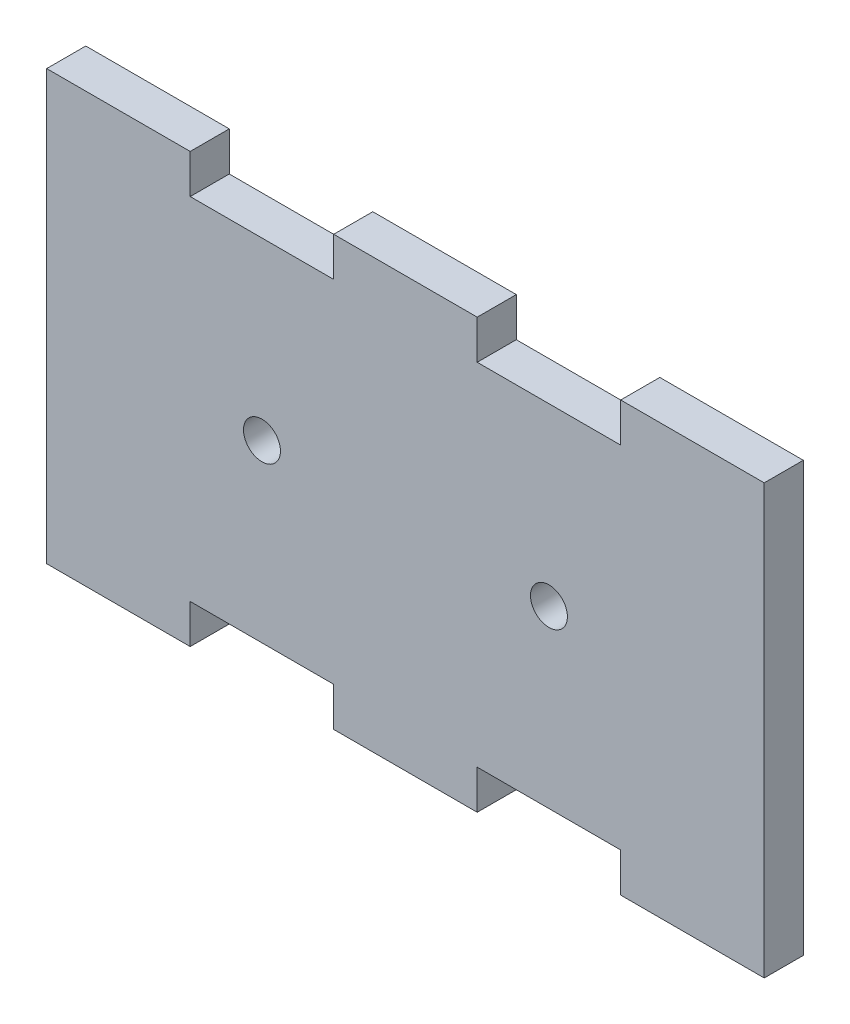
ISO-10303-21;
HEADER;
FILE_DESCRIPTION(('STEP AP214'),'2;1');
FILE_NAME('part.step','',(''),(''),'','','');
FILE_SCHEMA(('AUTOMOTIVE_DESIGN { 1 0 10303 214 1 1 1 1 }'));
ENDSEC;
DATA;
#1=APPLICATION_CONTEXT('core data for automotive mechanical design processes');
#2=APPLICATION_PROTOCOL_DEFINITION('international standard','automotive_design',2000,#1);
#3=PRODUCT_CONTEXT('',#1,'mechanical');
#4=PRODUCT('Part','Part','',(#3));
#5=PRODUCT_RELATED_PRODUCT_CATEGORY('part','',(#4));
#6=PRODUCT_DEFINITION_FORMATION('','',#4);
#7=PRODUCT_DEFINITION_CONTEXT('part definition',#1,'design');
#8=PRODUCT_DEFINITION('design','',#6,#7);
#9=PRODUCT_DEFINITION_SHAPE('','',#8);
#10=(LENGTH_UNIT() NAMED_UNIT(*) SI_UNIT(.MILLI.,.METRE.));
#11=(NAMED_UNIT(*) PLANE_ANGLE_UNIT() SI_UNIT($,.RADIAN.));
#12=(NAMED_UNIT(*) SI_UNIT($,.STERADIAN.) SOLID_ANGLE_UNIT());
#13=UNCERTAINTY_MEASURE_WITH_UNIT(LENGTH_MEASURE(1.E-05),#10,'distance_accuracy_value','');
#14=(GEOMETRIC_REPRESENTATION_CONTEXT(3) GLOBAL_UNCERTAINTY_ASSIGNED_CONTEXT((#13)) GLOBAL_UNIT_ASSIGNED_CONTEXT((#10,
#11,#12)) REPRESENTATION_CONTEXT('',''));
#15=CARTESIAN_POINT('',(0.,0.,0.));
#16=DIRECTION('',(0.,0.,1.));
#17=DIRECTION('',(1.,0.,0.));
#18=AXIS2_PLACEMENT_3D('',#15,#16,#17);
#19=CARTESIAN_POINT('',(17.485,0.,3.175));
#20=DIRECTION('',(0.,0.,-1.));
#21=DIRECTION('',(-1.,0.,0.));
#22=AXIS2_PLACEMENT_3D('',#19,#20,#21);
#23=CYLINDRICAL_SURFACE('',#22,1.5);
#24=CARTESIAN_POINT('',(17.485,0.,0.));
#25=DIRECTION('',(0.,0.,-1.));
#26=DIRECTION('',(1.,0.,0.));
#27=AXIS2_PLACEMENT_3D('',#24,#25,#26);
#28=CIRCLE('',#27,1.5);
#29=CARTESIAN_POINT('',(18.985,0.,0.));
#30=VERTEX_POINT('',#29);
#31=EDGE_CURVE('E131',#30,#30,#28,.T.);
#32=ORIENTED_EDGE('',*,*,#31,.T.);
#33=EDGE_LOOP('',(#32));
#34=FACE_BOUND('',#33,.T.);
#35=CARTESIAN_POINT('',(17.485,0.,3.175));
#36=DIRECTION('',(0.,0.,-1.));
#37=DIRECTION('',(1.,0.,0.));
#38=AXIS2_PLACEMENT_3D('',#35,#36,#37);
#39=CIRCLE('',#38,1.5);
#40=CARTESIAN_POINT('',(18.985,0.,3.175));
#41=VERTEX_POINT('',#40);
#42=EDGE_CURVE('E203',#41,#41,#39,.T.);
#43=ORIENTED_EDGE('',*,*,#42,.F.);
#44=EDGE_LOOP('',(#43));
#45=FACE_BOUND('',#44,.T.);
#46=ADVANCED_FACE('F39',(#34,#45),#23,.F.);
#47=CARTESIAN_POINT('',(29.14,17.415,3.175));
#48=DIRECTION('',(0.,-1.,0.));
#49=DIRECTION('',(0.,0.,-1.));
#50=AXIS2_PLACEMENT_3D('',#47,#48,#49);
#51=PLANE('',#50);
#52=DIRECTION('',(-1.,0.,0.));
#53=VECTOR('',#52,1.);
#54=CARTESIAN_POINT('',(29.14,17.415,0.));
#55=LINE('',#54,#53);
#56=CARTESIAN_POINT('',(34.968,17.415,0.));
#57=VERTEX_POINT('',#56);
#58=CARTESIAN_POINT('',(23.312,17.415,0.));
#59=VERTEX_POINT('',#58);
#60=EDGE_CURVE('E135',#57,#59,#55,.T.);
#61=ORIENTED_EDGE('',*,*,#60,.T.);
#62=DIRECTION('',(0.,0.,-1.));
#63=VECTOR('',#62,1.);
#64=CARTESIAN_POINT('',(23.312,17.415,3.175));
#65=LINE('',#64,#63);
#66=CARTESIAN_POINT('',(23.312,17.415,3.175));
#67=VERTEX_POINT('',#66);
#68=EDGE_CURVE('E11',#67,#59,#65,.T.);
#69=ORIENTED_EDGE('',*,*,#68,.F.);
#70=DIRECTION('',(-1.,0.,0.));
#71=VECTOR('',#70,1.);
#72=CARTESIAN_POINT('',(29.14,17.415,3.175));
#73=LINE('',#72,#71);
#74=CARTESIAN_POINT('',(34.968,17.415,3.175));
#75=VERTEX_POINT('',#74);
#76=EDGE_CURVE('E93',#75,#67,#73,.T.);
#77=ORIENTED_EDGE('',*,*,#76,.F.);
#78=DIRECTION('',(0.,0.,-1.));
#79=VECTOR('',#78,1.);
#80=CARTESIAN_POINT('',(34.968,17.415,3.175));
#81=LINE('',#80,#79);
#82=EDGE_CURVE('E250',#75,#57,#81,.T.);
#83=ORIENTED_EDGE('',*,*,#82,.T.);
#84=EDGE_LOOP('',(#61,#69,#77,#83));
#85=FACE_BOUND('',#84,.T.);
#86=ADVANCED_FACE('F213',(#85),#51,.F.);
#87=CARTESIAN_POINT('',(23.312,14.24,3.175));
#88=DIRECTION('',(1.,0.,0.));
#89=DIRECTION('',(0.,0.,-1.));
#90=AXIS2_PLACEMENT_3D('',#87,#88,#89);
#91=PLANE('',#90);
#92=DIRECTION('',(0.,-1.,0.));
#93=VECTOR('',#92,1.);
#94=CARTESIAN_POINT('',(23.312,14.24,0.));
#95=LINE('',#94,#93);
#96=CARTESIAN_POINT('',(23.312,14.24,0.));
#97=VERTEX_POINT('',#96);
#98=EDGE_CURVE('E139',#59,#97,#95,.T.);
#99=ORIENTED_EDGE('',*,*,#98,.T.);
#100=DIRECTION('',(0.,0.,-1.));
#101=VECTOR('',#100,1.);
#102=CARTESIAN_POINT('',(23.312,14.24,3.175));
#103=LINE('',#102,#101);
#104=CARTESIAN_POINT('',(23.312,14.24,3.175));
#105=VERTEX_POINT('',#104);
#106=EDGE_CURVE('E48',#105,#97,#103,.T.);
#107=ORIENTED_EDGE('',*,*,#106,.F.);
#108=DIRECTION('',(0.,-1.,0.));
#109=VECTOR('',#108,1.);
#110=CARTESIAN_POINT('',(23.312,14.24,3.175));
#111=LINE('',#110,#109);
#112=EDGE_CURVE('E108',#67,#105,#111,.T.);
#113=ORIENTED_EDGE('',*,*,#112,.F.);
#114=ORIENTED_EDGE('',*,*,#68,.T.);
#115=EDGE_LOOP('',(#99,#107,#113,#114));
#116=FACE_BOUND('',#115,.T.);
#117=ADVANCED_FACE('F218',(#116),#91,.F.);
#118=CARTESIAN_POINT('',(11.656,14.24,3.175));
#119=DIRECTION('',(0.,-1.,0.));
#120=DIRECTION('',(0.,0.,-1.));
#121=AXIS2_PLACEMENT_3D('',#118,#119,#120);
#122=PLANE('',#121);
#123=DIRECTION('',(-1.,0.,0.));
#124=VECTOR('',#123,1.);
#125=CARTESIAN_POINT('',(11.656,14.24,0.));
#126=LINE('',#125,#124);
#127=CARTESIAN_POINT('',(11.656,14.24,0.));
#128=VERTEX_POINT('',#127);
#129=EDGE_CURVE('E117',#97,#128,#126,.T.);
#130=ORIENTED_EDGE('',*,*,#129,.T.);
#131=DIRECTION('',(0.,0.,-1.));
#132=VECTOR('',#131,1.);
#133=CARTESIAN_POINT('',(11.656,14.24,3.175));
#134=LINE('',#133,#132);
#135=CARTESIAN_POINT('',(11.656,14.24,3.175));
#136=VERTEX_POINT('',#135);
#137=EDGE_CURVE('E114',#136,#128,#134,.T.);
#138=ORIENTED_EDGE('',*,*,#137,.F.);
#139=DIRECTION('',(-1.,0.,0.));
#140=VECTOR('',#139,1.);
#141=CARTESIAN_POINT('',(11.656,14.24,3.175));
#142=LINE('',#141,#140);
#143=EDGE_CURVE('E101',#105,#136,#142,.T.);
#144=ORIENTED_EDGE('',*,*,#143,.F.);
#145=ORIENTED_EDGE('',*,*,#106,.T.);
#146=EDGE_LOOP('',(#130,#138,#144,#145));
#147=FACE_BOUND('',#146,.T.);
#148=ADVANCED_FACE('F115',(#147),#122,.F.);
#149=CARTESIAN_POINT('',(11.656,14.24,3.175));
#150=DIRECTION('',(-1.,0.,0.));
#151=DIRECTION('',(0.,0.,1.));
#152=AXIS2_PLACEMENT_3D('',#149,#150,#151);
#153=PLANE('',#152);
#154=DIRECTION('',(0.,1.,0.));
#155=VECTOR('',#154,1.);
#156=CARTESIAN_POINT('',(11.656,14.24,0.));
#157=LINE('',#156,#155);
#158=CARTESIAN_POINT('',(11.656,17.415,0.));
#159=VERTEX_POINT('',#158);
#160=EDGE_CURVE('E78',#128,#159,#157,.T.);
#161=ORIENTED_EDGE('',*,*,#160,.T.);
#162=DIRECTION('',(0.,0.,-1.));
#163=VECTOR('',#162,1.);
#164=CARTESIAN_POINT('',(11.656,17.415,3.175));
#165=LINE('',#164,#163);
#166=CARTESIAN_POINT('',(11.656,17.415,3.175));
#167=VERTEX_POINT('',#166);
#168=EDGE_CURVE('E119',#167,#159,#165,.T.);
#169=ORIENTED_EDGE('',*,*,#168,.F.);
#170=DIRECTION('',(0.,1.,0.));
#171=VECTOR('',#170,1.);
#172=CARTESIAN_POINT('',(11.656,14.24,3.175));
#173=LINE('',#172,#171);
#174=EDGE_CURVE('E106',#136,#167,#173,.T.);
#175=ORIENTED_EDGE('',*,*,#174,.F.);
#176=ORIENTED_EDGE('',*,*,#137,.T.);
#177=EDGE_LOOP('',(#161,#169,#175,#176));
#178=FACE_BOUND('',#177,.T.);
#179=ADVANCED_FACE('F121',(#178),#153,.F.);
#180=CARTESIAN_POINT('',(0.,17.415,3.175));
#181=DIRECTION('',(0.,-1.,0.));
#182=DIRECTION('',(0.,0.,-1.));
#183=AXIS2_PLACEMENT_3D('',#180,#181,#182);
#184=PLANE('',#183);
#185=DIRECTION('',(-1.,0.,0.));
#186=VECTOR('',#185,1.);
#187=CARTESIAN_POINT('',(0.,17.415,0.));
#188=LINE('',#187,#186);
#189=CARTESIAN_POINT('',(0.,17.415,0.));
#190=VERTEX_POINT('',#189);
#191=EDGE_CURVE('E85',#159,#190,#188,.T.);
#192=ORIENTED_EDGE('',*,*,#191,.T.);
#193=DIRECTION('',(0.,0.,-1.));
#194=VECTOR('',#193,1.);
#195=CARTESIAN_POINT('',(0.,17.415,3.175));
#196=LINE('',#195,#194);
#197=CARTESIAN_POINT('',(0.,17.415,3.175));
#198=VERTEX_POINT('',#197);
#199=EDGE_CURVE('E127',#198,#190,#196,.T.);
#200=ORIENTED_EDGE('',*,*,#199,.F.);
#201=DIRECTION('',(-1.,0.,0.));
#202=VECTOR('',#201,1.);
#203=CARTESIAN_POINT('',(0.,17.415,3.175));
#204=LINE('',#203,#202);
#205=EDGE_CURVE('E124',#167,#198,#204,.T.);
#206=ORIENTED_EDGE('',*,*,#205,.F.);
#207=ORIENTED_EDGE('',*,*,#168,.T.);
#208=EDGE_LOOP('',(#192,#200,#206,#207));
#209=FACE_BOUND('',#208,.T.);
#210=ADVANCED_FACE('F236',(#209),#184,.F.);
#211=CARTESIAN_POINT('',(0.,14.24,3.175));
#212=DIRECTION('',(1.,0.,0.));
#213=DIRECTION('',(0.,0.,-1.));
#214=AXIS2_PLACEMENT_3D('',#211,#212,#213);
#215=PLANE('',#214);
#216=DIRECTION('',(0.,-1.,0.));
#217=VECTOR('',#216,1.);
#218=CARTESIAN_POINT('',(0.,14.24,0.));
#219=LINE('',#218,#217);
#220=CARTESIAN_POINT('',(0.,-17.415,0.));
#221=VERTEX_POINT('',#220);
#222=EDGE_CURVE('E148',#190,#221,#219,.T.);
#223=ORIENTED_EDGE('',*,*,#222,.T.);
#224=DIRECTION('',(0.,0.,-1.));
#225=VECTOR('',#224,1.);
#226=CARTESIAN_POINT('',(0.,-17.415,3.175));
#227=LINE('',#226,#225);
#228=CARTESIAN_POINT('',(0.,-17.415,3.175));
#229=VERTEX_POINT('',#228);
#230=EDGE_CURVE('E169',#229,#221,#227,.T.);
#231=ORIENTED_EDGE('',*,*,#230,.F.);
#232=DIRECTION('',(0.,-1.,0.));
#233=VECTOR('',#232,1.);
#234=CARTESIAN_POINT('',(0.,0.,3.175));
#235=LINE('',#234,#233);
#236=EDGE_CURVE('E56',#198,#229,#235,.T.);
#237=ORIENTED_EDGE('',*,*,#236,.F.);
#238=ORIENTED_EDGE('',*,*,#199,.T.);
#239=EDGE_LOOP('',(#223,#231,#237,#238));
#240=FACE_BOUND('',#239,.T.);
#241=ADVANCED_FACE('F168',(#240),#215,.F.);
#242=CARTESIAN_POINT('',(17.485,0.,3.175));
#243=DIRECTION('',(0.,0.,1.));
#244=DIRECTION('',(1.,0.,0.));
#245=AXIS2_PLACEMENT_3D('',#242,#243,#244);
#246=PLANE('',#245);
#247=ORIENTED_EDGE('',*,*,#42,.T.);
#248=EDGE_LOOP('',(#247));
#249=FACE_BOUND('',#248,.T.);
#250=ORIENTED_EDGE('',*,*,#236,.T.);
#251=DIRECTION('',(-1.,0.,0.));
#252=VECTOR('',#251,1.);
#253=CARTESIAN_POINT('',(0.,-17.415,3.175));
#254=LINE('',#253,#252);
#255=CARTESIAN_POINT('',(11.656,-17.415,3.175));
#256=VERTEX_POINT('',#255);
#257=EDGE_CURVE('E178',#256,#229,#254,.T.);
#258=ORIENTED_EDGE('',*,*,#257,.F.);
#259=DIRECTION('',(0.,-1.,0.));
#260=VECTOR('',#259,1.);
#261=CARTESIAN_POINT('',(11.656,-14.24,3.175));
#262=LINE('',#261,#260);
#263=CARTESIAN_POINT('',(11.656,-14.24,3.175));
#264=VERTEX_POINT('',#263);
#265=EDGE_CURVE('E186',#264,#256,#262,.T.);
#266=ORIENTED_EDGE('',*,*,#265,.F.);
#267=DIRECTION('',(-1.,0.,0.));
#268=VECTOR('',#267,1.);
#269=CARTESIAN_POINT('',(11.656,-14.24,3.175));
#270=LINE('',#269,#268);
#271=CARTESIAN_POINT('',(23.312,-14.24,3.175));
#272=VERTEX_POINT('',#271);
#273=EDGE_CURVE('E315',#272,#264,#270,.T.);
#274=ORIENTED_EDGE('',*,*,#273,.F.);
#275=DIRECTION('',(0.,1.,0.));
#276=VECTOR('',#275,1.);
#277=CARTESIAN_POINT('',(23.312,-14.24,3.175));
#278=LINE('',#277,#276);
#279=CARTESIAN_POINT('',(23.312,-17.415,3.175));
#280=VERTEX_POINT('',#279);
#281=EDGE_CURVE('E311',#280,#272,#278,.T.);
#282=ORIENTED_EDGE('',*,*,#281,.F.);
#283=DIRECTION('',(-1.,0.,0.));
#284=VECTOR('',#283,1.);
#285=CARTESIAN_POINT('',(29.14,-17.415,3.175));
#286=LINE('',#285,#284);
#287=CARTESIAN_POINT('',(34.968,-17.415,3.175));
#288=VERTEX_POINT('',#287);
#289=EDGE_CURVE('E307',#288,#280,#286,.T.);
#290=ORIENTED_EDGE('',*,*,#289,.F.);
#291=DIRECTION('',(0.,1.,0.));
#292=VECTOR('',#291,1.);
#293=CARTESIAN_POINT('',(34.968,-14.24,3.175));
#294=LINE('',#293,#292);
#295=CARTESIAN_POINT('',(34.968,-14.24,3.175));
#296=VERTEX_POINT('',#295);
#297=EDGE_CURVE('E459',#288,#296,#294,.T.);
#298=ORIENTED_EDGE('',*,*,#297,.T.);
#299=DIRECTION('',(1.,0.,0.));
#300=VECTOR('',#299,1.);
#301=CARTESIAN_POINT('',(46.624,-14.24,3.175));
#302=LINE('',#301,#300);
#303=CARTESIAN_POINT('',(46.624,-14.24,3.175));
#304=VERTEX_POINT('',#303);
#305=EDGE_CURVE('E469',#296,#304,#302,.T.);
#306=ORIENTED_EDGE('',*,*,#305,.T.);
#307=DIRECTION('',(0.,-1.,0.));
#308=VECTOR('',#307,1.);
#309=CARTESIAN_POINT('',(46.624,-14.24,3.175));
#310=LINE('',#309,#308);
#311=CARTESIAN_POINT('',(46.624,-17.415,3.175));
#312=VERTEX_POINT('',#311);
#313=EDGE_CURVE('E474',#304,#312,#310,.T.);
#314=ORIENTED_EDGE('',*,*,#313,.T.);
#315=DIRECTION('',(1.,0.,0.));
#316=VECTOR('',#315,1.);
#317=CARTESIAN_POINT('',(58.28,-17.415,3.175));
#318=LINE('',#317,#316);
#319=CARTESIAN_POINT('',(58.28,-17.415,3.175));
#320=VERTEX_POINT('',#319);
#321=EDGE_CURVE('E485',#312,#320,#318,.T.);
#322=ORIENTED_EDGE('',*,*,#321,.T.);
#323=DIRECTION('',(0.,-1.,0.));
#324=VECTOR('',#323,1.);
#325=CARTESIAN_POINT('',(58.28,0.,3.175));
#326=LINE('',#325,#324);
#327=CARTESIAN_POINT('',(58.28,17.415,3.175));
#328=VERTEX_POINT('',#327);
#329=EDGE_CURVE('E288',#328,#320,#326,.T.);
#330=ORIENTED_EDGE('',*,*,#329,.F.);
#331=DIRECTION('',(1.,0.,0.));
#332=VECTOR('',#331,1.);
#333=CARTESIAN_POINT('',(58.28,17.415,3.175));
#334=LINE('',#333,#332);
#335=CARTESIAN_POINT('',(46.624,17.415,3.175));
#336=VERTEX_POINT('',#335);
#337=EDGE_CURVE('E294',#336,#328,#334,.T.);
#338=ORIENTED_EDGE('',*,*,#337,.F.);
#339=DIRECTION('',(0.,1.,0.));
#340=VECTOR('',#339,1.);
#341=CARTESIAN_POINT('',(46.624,14.24,3.175));
#342=LINE('',#341,#340);
#343=CARTESIAN_POINT('',(46.624,14.24,3.175));
#344=VERTEX_POINT('',#343);
#345=EDGE_CURVE('E397',#344,#336,#342,.T.);
#346=ORIENTED_EDGE('',*,*,#345,.F.);
#347=DIRECTION('',(1.,0.,0.));
#348=VECTOR('',#347,1.);
#349=CARTESIAN_POINT('',(46.624,14.24,3.175));
#350=LINE('',#349,#348);
#351=CARTESIAN_POINT('',(34.968,14.24,3.175));
#352=VERTEX_POINT('',#351);
#353=EDGE_CURVE('E400',#352,#344,#350,.T.);
#354=ORIENTED_EDGE('',*,*,#353,.F.);
#355=DIRECTION('',(0.,-1.,0.));
#356=VECTOR('',#355,1.);
#357=CARTESIAN_POINT('',(34.968,14.24,3.175));
#358=LINE('',#357,#356);
#359=EDGE_CURVE('E410',#75,#352,#358,.T.);
#360=ORIENTED_EDGE('',*,*,#359,.F.);
#361=ORIENTED_EDGE('',*,*,#76,.T.);
#362=ORIENTED_EDGE('',*,*,#112,.T.);
#363=ORIENTED_EDGE('',*,*,#143,.T.);
#364=ORIENTED_EDGE('',*,*,#174,.T.);
#365=ORIENTED_EDGE('',*,*,#205,.T.);
#366=EDGE_LOOP('',(#250,#258,#266,#274,#282,#290,#298,#306,#314,#322,#330,#338,#346,#354,#360,
#361,#362,#363,#364,#365));
#367=FACE_BOUND('',#366,.T.);
#368=CARTESIAN_POINT('',(40.795,0.,3.175));
#369=DIRECTION('',(0.,0.,1.));
#370=DIRECTION('',(-1.,0.,0.));
#371=AXIS2_PLACEMENT_3D('',#368,#369,#370);
#372=CIRCLE('',#371,1.5);
#373=CARTESIAN_POINT('',(39.295,0.,3.175));
#374=VERTEX_POINT('',#373);
#375=EDGE_CURVE('E413',#374,#374,#372,.T.);
#376=ORIENTED_EDGE('',*,*,#375,.F.);
#377=EDGE_LOOP('',(#376));
#378=FACE_BOUND('',#377,.T.);
#379=ADVANCED_FACE('F103',(#249,#367,#378),#246,.T.);
#380=CARTESIAN_POINT('',(17.485,0.,0.));
#381=DIRECTION('',(0.,0.,1.));
#382=DIRECTION('',(1.,0.,0.));
#383=AXIS2_PLACEMENT_3D('',#380,#381,#382);
#384=PLANE('',#383);
#385=ORIENTED_EDGE('',*,*,#31,.F.);
#386=EDGE_LOOP('',(#385));
#387=FACE_BOUND('',#386,.T.);
#388=DIRECTION('',(-1.,0.,0.));
#389=VECTOR('',#388,1.);
#390=CARTESIAN_POINT('',(0.,-17.415,0.));
#391=LINE('',#390,#389);
#392=CARTESIAN_POINT('',(11.656,-17.415,0.));
#393=VERTEX_POINT('',#392);
#394=EDGE_CURVE('E166',#393,#221,#391,.T.);
#395=ORIENTED_EDGE('',*,*,#394,.T.);
#396=ORIENTED_EDGE('',*,*,#222,.F.);
#397=ORIENTED_EDGE('',*,*,#191,.F.);
#398=ORIENTED_EDGE('',*,*,#160,.F.);
#399=ORIENTED_EDGE('',*,*,#129,.F.);
#400=ORIENTED_EDGE('',*,*,#98,.F.);
#401=ORIENTED_EDGE('',*,*,#60,.F.);
#402=DIRECTION('',(0.,-1.,0.));
#403=VECTOR('',#402,1.);
#404=CARTESIAN_POINT('',(34.968,14.24,0.));
#405=LINE('',#404,#403);
#406=CARTESIAN_POINT('',(34.968,14.24,0.));
#407=VERTEX_POINT('',#406);
#408=EDGE_CURVE('E255',#57,#407,#405,.T.);
#409=ORIENTED_EDGE('',*,*,#408,.T.);
#410=DIRECTION('',(1.,0.,0.));
#411=VECTOR('',#410,1.);
#412=CARTESIAN_POINT('',(46.624,14.24,0.));
#413=LINE('',#412,#411);
#414=CARTESIAN_POINT('',(46.624,14.24,0.));
#415=VERTEX_POINT('',#414);
#416=EDGE_CURVE('E265',#407,#415,#413,.T.);
#417=ORIENTED_EDGE('',*,*,#416,.T.);
#418=DIRECTION('',(0.,1.,0.));
#419=VECTOR('',#418,1.);
#420=CARTESIAN_POINT('',(46.624,14.24,0.));
#421=LINE('',#420,#419);
#422=CARTESIAN_POINT('',(46.624,17.415,0.));
#423=VERTEX_POINT('',#422);
#424=EDGE_CURVE('E270',#415,#423,#421,.T.);
#425=ORIENTED_EDGE('',*,*,#424,.T.);
#426=DIRECTION('',(1.,0.,0.));
#427=VECTOR('',#426,1.);
#428=CARTESIAN_POINT('',(58.28,17.415,0.));
#429=LINE('',#428,#427);
#430=CARTESIAN_POINT('',(58.28,17.415,0.));
#431=VERTEX_POINT('',#430);
#432=EDGE_CURVE('E280',#423,#431,#429,.T.);
#433=ORIENTED_EDGE('',*,*,#432,.T.);
#434=DIRECTION('',(0.,-1.,0.));
#435=VECTOR('',#434,1.);
#436=CARTESIAN_POINT('',(58.28,14.24,0.));
#437=LINE('',#436,#435);
#438=CARTESIAN_POINT('',(58.28,-17.415,0.));
#439=VERTEX_POINT('',#438);
#440=EDGE_CURVE('E284',#431,#439,#437,.T.);
#441=ORIENTED_EDGE('',*,*,#440,.T.);
#442=DIRECTION('',(1.,0.,0.));
#443=VECTOR('',#442,1.);
#444=CARTESIAN_POINT('',(58.28,-17.415,0.));
#445=LINE('',#444,#443);
#446=CARTESIAN_POINT('',(46.624,-17.415,0.));
#447=VERTEX_POINT('',#446);
#448=EDGE_CURVE('E423',#447,#439,#445,.T.);
#449=ORIENTED_EDGE('',*,*,#448,.F.);
#450=DIRECTION('',(0.,-1.,0.));
#451=VECTOR('',#450,1.);
#452=CARTESIAN_POINT('',(46.624,-14.24,0.));
#453=LINE('',#452,#451);
#454=CARTESIAN_POINT('',(46.624,-14.24,0.));
#455=VERTEX_POINT('',#454);
#456=EDGE_CURVE('E480',#455,#447,#453,.T.);
#457=ORIENTED_EDGE('',*,*,#456,.F.);
#458=DIRECTION('',(1.,0.,0.));
#459=VECTOR('',#458,1.);
#460=CARTESIAN_POINT('',(46.624,-14.24,0.));
#461=LINE('',#460,#459);
#462=CARTESIAN_POINT('',(34.968,-14.24,0.));
#463=VERTEX_POINT('',#462);
#464=EDGE_CURVE('E491',#463,#455,#461,.T.);
#465=ORIENTED_EDGE('',*,*,#464,.F.);
#466=DIRECTION('',(0.,1.,0.));
#467=VECTOR('',#466,1.);
#468=CARTESIAN_POINT('',(34.968,-14.24,0.));
#469=LINE('',#468,#467);
#470=CARTESIAN_POINT('',(34.968,-17.415,0.));
#471=VERTEX_POINT('',#470);
#472=EDGE_CURVE('E461',#471,#463,#469,.T.);
#473=ORIENTED_EDGE('',*,*,#472,.F.);
#474=DIRECTION('',(-1.,0.,0.));
#475=VECTOR('',#474,1.);
#476=CARTESIAN_POINT('',(29.14,-17.415,0.));
#477=LINE('',#476,#475);
#478=CARTESIAN_POINT('',(23.312,-17.415,0.));
#479=VERTEX_POINT('',#478);
#480=EDGE_CURVE('E306',#471,#479,#477,.T.);
#481=ORIENTED_EDGE('',*,*,#480,.T.);
#482=DIRECTION('',(0.,1.,0.));
#483=VECTOR('',#482,1.);
#484=CARTESIAN_POINT('',(23.312,-14.24,0.));
#485=LINE('',#484,#483);
#486=CARTESIAN_POINT('',(23.312,-14.24,0.));
#487=VERTEX_POINT('',#486);
#488=EDGE_CURVE('E325',#479,#487,#485,.T.);
#489=ORIENTED_EDGE('',*,*,#488,.T.);
#490=DIRECTION('',(-1.,0.,0.));
#491=VECTOR('',#490,1.);
#492=CARTESIAN_POINT('',(11.656,-14.24,0.));
#493=LINE('',#492,#491);
#494=CARTESIAN_POINT('',(11.656,-14.24,0.));
#495=VERTEX_POINT('',#494);
#496=EDGE_CURVE('E329',#487,#495,#493,.T.);
#497=ORIENTED_EDGE('',*,*,#496,.T.);
#498=DIRECTION('',(0.,-1.,0.));
#499=VECTOR('',#498,1.);
#500=CARTESIAN_POINT('',(11.656,-14.24,0.));
#501=LINE('',#500,#499);
#502=EDGE_CURVE('E332',#495,#393,#501,.T.);
#503=ORIENTED_EDGE('',*,*,#502,.T.);
#504=EDGE_LOOP('',(#395,#396,#397,#398,#399,#400,#401,#409,#417,#425,#433,#441,#449,#457,#465,
#473,#481,#489,#497,#503));
#505=FACE_BOUND('',#504,.T.);
#506=CARTESIAN_POINT('',(40.795,0.,0.));
#507=DIRECTION('',(0.,0.,1.));
#508=DIRECTION('',(-1.,0.,0.));
#509=AXIS2_PLACEMENT_3D('',#506,#507,#508);
#510=CIRCLE('',#509,1.5);
#511=CARTESIAN_POINT('',(39.295,0.,0.));
#512=VERTEX_POINT('',#511);
#513=EDGE_CURVE('E266',#512,#512,#510,.T.);
#514=ORIENTED_EDGE('',*,*,#513,.T.);
#515=EDGE_LOOP('',(#514));
#516=FACE_BOUND('',#515,.T.);
#517=ADVANCED_FACE('F160',(#387,#505,#516),#384,.F.);
#518=CARTESIAN_POINT('',(29.14,-17.415,3.175));
#519=DIRECTION('',(0.,1.,0.));
#520=DIRECTION('',(0.,0.,-1.));
#521=AXIS2_PLACEMENT_3D('',#518,#519,#520);
#522=PLANE('',#521);
#523=ORIENTED_EDGE('',*,*,#480,.F.);
#524=DIRECTION('',(0.,0.,-1.));
#525=VECTOR('',#524,1.);
#526=CARTESIAN_POINT('',(34.968,-17.415,3.175));
#527=LINE('',#526,#525);
#528=EDGE_CURVE('E273',#288,#471,#527,.T.);
#529=ORIENTED_EDGE('',*,*,#528,.F.);
#530=ORIENTED_EDGE('',*,*,#289,.T.);
#531=DIRECTION('',(0.,0.,-1.));
#532=VECTOR('',#531,1.);
#533=CARTESIAN_POINT('',(23.312,-17.415,3.175));
#534=LINE('',#533,#532);
#535=EDGE_CURVE('E136',#280,#479,#534,.T.);
#536=ORIENTED_EDGE('',*,*,#535,.T.);
#537=EDGE_LOOP('',(#523,#529,#530,#536));
#538=FACE_BOUND('',#537,.T.);
#539=ADVANCED_FACE('F223',(#538),#522,.F.);
#540=CARTESIAN_POINT('',(23.312,-14.24,3.175));
#541=DIRECTION('',(1.,0.,0.));
#542=DIRECTION('',(0.,0.,-1.));
#543=AXIS2_PLACEMENT_3D('',#540,#541,#542);
#544=PLANE('',#543);
#545=ORIENTED_EDGE('',*,*,#488,.F.);
#546=ORIENTED_EDGE('',*,*,#535,.F.);
#547=ORIENTED_EDGE('',*,*,#281,.T.);
#548=DIRECTION('',(0.,0.,-1.));
#549=VECTOR('',#548,1.);
#550=CARTESIAN_POINT('',(23.312,-14.24,3.175));
#551=LINE('',#550,#549);
#552=EDGE_CURVE('E194',#272,#487,#551,.T.);
#553=ORIENTED_EDGE('',*,*,#552,.T.);
#554=EDGE_LOOP('',(#545,#546,#547,#553));
#555=FACE_BOUND('',#554,.T.);
#556=ADVANCED_FACE('F229',(#555),#544,.F.);
#557=CARTESIAN_POINT('',(11.656,-14.24,3.175));
#558=DIRECTION('',(0.,1.,0.));
#559=DIRECTION('',(0.,0.,-1.));
#560=AXIS2_PLACEMENT_3D('',#557,#558,#559);
#561=PLANE('',#560);
#562=ORIENTED_EDGE('',*,*,#496,.F.);
#563=ORIENTED_EDGE('',*,*,#552,.F.);
#564=ORIENTED_EDGE('',*,*,#273,.T.);
#565=DIRECTION('',(0.,0.,-1.));
#566=VECTOR('',#565,1.);
#567=CARTESIAN_POINT('',(11.656,-14.24,3.175));
#568=LINE('',#567,#566);
#569=EDGE_CURVE('E184',#264,#495,#568,.T.);
#570=ORIENTED_EDGE('',*,*,#569,.T.);
#571=EDGE_LOOP('',(#562,#563,#564,#570));
#572=FACE_BOUND('',#571,.T.);
#573=ADVANCED_FACE('F345',(#572),#561,.F.);
#574=CARTESIAN_POINT('',(11.656,-14.24,3.175));
#575=DIRECTION('',(-1.,0.,0.));
#576=DIRECTION('',(0.,0.,1.));
#577=AXIS2_PLACEMENT_3D('',#574,#575,#576);
#578=PLANE('',#577);
#579=ORIENTED_EDGE('',*,*,#502,.F.);
#580=ORIENTED_EDGE('',*,*,#569,.F.);
#581=ORIENTED_EDGE('',*,*,#265,.T.);
#582=DIRECTION('',(0.,0.,-1.));
#583=VECTOR('',#582,1.);
#584=CARTESIAN_POINT('',(11.656,-17.415,3.175));
#585=LINE('',#584,#583);
#586=EDGE_CURVE('E180',#256,#393,#585,.T.);
#587=ORIENTED_EDGE('',*,*,#586,.T.);
#588=EDGE_LOOP('',(#579,#580,#581,#587));
#589=FACE_BOUND('',#588,.T.);
#590=ADVANCED_FACE('F340',(#589),#578,.F.);
#591=CARTESIAN_POINT('',(0.,-17.415,3.175));
#592=DIRECTION('',(0.,1.,0.));
#593=DIRECTION('',(0.,0.,-1.));
#594=AXIS2_PLACEMENT_3D('',#591,#592,#593);
#595=PLANE('',#594);
#596=ORIENTED_EDGE('',*,*,#394,.F.);
#597=ORIENTED_EDGE('',*,*,#586,.F.);
#598=ORIENTED_EDGE('',*,*,#257,.T.);
#599=ORIENTED_EDGE('',*,*,#230,.T.);
#600=EDGE_LOOP('',(#596,#597,#598,#599));
#601=FACE_BOUND('',#600,.T.);
#602=ADVANCED_FACE('F174',(#601),#595,.F.);
#603=CARTESIAN_POINT('',(40.795,0.,3.175));
#604=DIRECTION('',(0.,0.,-1.));
#605=DIRECTION('',(1.,0.,0.));
#606=AXIS2_PLACEMENT_3D('',#603,#604,#605);
#607=CYLINDRICAL_SURFACE('',#606,1.5);
#608=ORIENTED_EDGE('',*,*,#513,.F.);
#609=EDGE_LOOP('',(#608));
#610=FACE_BOUND('',#609,.T.);
#611=ORIENTED_EDGE('',*,*,#375,.T.);
#612=EDGE_LOOP('',(#611));
#613=FACE_BOUND('',#612,.T.);
#614=ADVANCED_FACE('F509',(#610,#613),#607,.F.);
#615=CARTESIAN_POINT('',(34.968,14.24,3.175));
#616=DIRECTION('',(-1.,0.,0.));
#617=DIRECTION('',(0.,0.,-1.));
#618=AXIS2_PLACEMENT_3D('',#615,#616,#617);
#619=PLANE('',#618);
#620=ORIENTED_EDGE('',*,*,#408,.F.);
#621=ORIENTED_EDGE('',*,*,#82,.F.);
#622=ORIENTED_EDGE('',*,*,#359,.T.);
#623=DIRECTION('',(0.,0.,-1.));
#624=VECTOR('',#623,1.);
#625=CARTESIAN_POINT('',(34.968,14.24,3.175));
#626=LINE('',#625,#624);
#627=EDGE_CURVE('E263',#352,#407,#626,.T.);
#628=ORIENTED_EDGE('',*,*,#627,.T.);
#629=EDGE_LOOP('',(#620,#621,#622,#628));
#630=FACE_BOUND('',#629,.T.);
#631=ADVANCED_FACE('F260',(#630),#619,.F.);
#632=CARTESIAN_POINT('',(46.624,14.24,3.175));
#633=DIRECTION('',(0.,-1.,0.));
#634=DIRECTION('',(0.,0.,-1.));
#635=AXIS2_PLACEMENT_3D('',#632,#633,#634);
#636=PLANE('',#635);
#637=ORIENTED_EDGE('',*,*,#416,.F.);
#638=ORIENTED_EDGE('',*,*,#627,.F.);
#639=ORIENTED_EDGE('',*,*,#353,.T.);
#640=DIRECTION('',(0.,0.,-1.));
#641=VECTOR('',#640,1.);
#642=CARTESIAN_POINT('',(46.624,14.24,3.175));
#643=LINE('',#642,#641);
#644=EDGE_CURVE('E298',#344,#415,#643,.T.);
#645=ORIENTED_EDGE('',*,*,#644,.T.);
#646=EDGE_LOOP('',(#637,#638,#639,#645));
#647=FACE_BOUND('',#646,.T.);
#648=ADVANCED_FACE('F408',(#647),#636,.F.);
#649=CARTESIAN_POINT('',(46.624,14.24,3.175));
#650=DIRECTION('',(1.,0.,0.));
#651=DIRECTION('',(0.,0.,1.));
#652=AXIS2_PLACEMENT_3D('',#649,#650,#651);
#653=PLANE('',#652);
#654=ORIENTED_EDGE('',*,*,#424,.F.);
#655=ORIENTED_EDGE('',*,*,#644,.F.);
#656=ORIENTED_EDGE('',*,*,#345,.T.);
#657=DIRECTION('',(0.,0.,-1.));
#658=VECTOR('',#657,1.);
#659=CARTESIAN_POINT('',(46.624,17.415,3.175));
#660=LINE('',#659,#658);
#661=EDGE_CURVE('E293',#336,#423,#660,.T.);
#662=ORIENTED_EDGE('',*,*,#661,.T.);
#663=EDGE_LOOP('',(#654,#655,#656,#662));
#664=FACE_BOUND('',#663,.T.);
#665=ADVANCED_FACE('F406',(#664),#653,.F.);
#666=CARTESIAN_POINT('',(58.28,17.415,3.175));
#667=DIRECTION('',(0.,-1.,0.));
#668=DIRECTION('',(0.,0.,-1.));
#669=AXIS2_PLACEMENT_3D('',#666,#667,#668);
#670=PLANE('',#669);
#671=ORIENTED_EDGE('',*,*,#432,.F.);
#672=ORIENTED_EDGE('',*,*,#661,.F.);
#673=ORIENTED_EDGE('',*,*,#337,.T.);
#674=DIRECTION('',(0.,0.,-1.));
#675=VECTOR('',#674,1.);
#676=CARTESIAN_POINT('',(58.28,17.415,3.175));
#677=LINE('',#676,#675);
#678=EDGE_CURVE('E289',#328,#431,#677,.T.);
#679=ORIENTED_EDGE('',*,*,#678,.T.);
#680=EDGE_LOOP('',(#671,#672,#673,#679));
#681=FACE_BOUND('',#680,.T.);
#682=ADVANCED_FACE('F418',(#681),#670,.F.);
#683=CARTESIAN_POINT('',(58.28,14.24,3.175));
#684=DIRECTION('',(-1.,0.,0.));
#685=DIRECTION('',(0.,0.,-1.));
#686=AXIS2_PLACEMENT_3D('',#683,#684,#685);
#687=PLANE('',#686);
#688=ORIENTED_EDGE('',*,*,#440,.F.);
#689=ORIENTED_EDGE('',*,*,#678,.F.);
#690=ORIENTED_EDGE('',*,*,#329,.T.);
#691=DIRECTION('',(0.,0.,-1.));
#692=VECTOR('',#691,1.);
#693=CARTESIAN_POINT('',(58.28,-17.415,3.175));
#694=LINE('',#693,#692);
#695=EDGE_CURVE('E488',#320,#439,#694,.T.);
#696=ORIENTED_EDGE('',*,*,#695,.T.);
#697=EDGE_LOOP('',(#688,#689,#690,#696));
#698=FACE_BOUND('',#697,.T.);
#699=ADVANCED_FACE('F622',(#698),#687,.F.);
#700=CARTESIAN_POINT('',(34.968,-14.24,3.175));
#701=DIRECTION('',(-1.,0.,0.));
#702=DIRECTION('',(0.,0.,-1.));
#703=AXIS2_PLACEMENT_3D('',#700,#701,#702);
#704=PLANE('',#703);
#705=ORIENTED_EDGE('',*,*,#472,.T.);
#706=DIRECTION('',(0.,0.,-1.));
#707=VECTOR('',#706,1.);
#708=CARTESIAN_POINT('',(34.968,-14.24,3.175));
#709=LINE('',#708,#707);
#710=EDGE_CURVE('E454',#296,#463,#709,.T.);
#711=ORIENTED_EDGE('',*,*,#710,.F.);
#712=ORIENTED_EDGE('',*,*,#297,.F.);
#713=ORIENTED_EDGE('',*,*,#528,.T.);
#714=EDGE_LOOP('',(#705,#711,#712,#713));
#715=FACE_BOUND('',#714,.T.);
#716=ADVANCED_FACE('F456',(#715),#704,.F.);
#717=CARTESIAN_POINT('',(46.624,-14.24,3.175));
#718=DIRECTION('',(0.,1.,0.));
#719=DIRECTION('',(0.,0.,-1.));
#720=AXIS2_PLACEMENT_3D('',#717,#718,#719);
#721=PLANE('',#720);
#722=ORIENTED_EDGE('',*,*,#464,.T.);
#723=DIRECTION('',(0.,0.,-1.));
#724=VECTOR('',#723,1.);
#725=CARTESIAN_POINT('',(46.624,-14.24,3.175));
#726=LINE('',#725,#724);
#727=EDGE_CURVE('E466',#304,#455,#726,.T.);
#728=ORIENTED_EDGE('',*,*,#727,.F.);
#729=ORIENTED_EDGE('',*,*,#305,.F.);
#730=ORIENTED_EDGE('',*,*,#710,.T.);
#731=EDGE_LOOP('',(#722,#728,#729,#730));
#732=FACE_BOUND('',#731,.T.);
#733=ADVANCED_FACE('F470',(#732),#721,.F.);
#734=CARTESIAN_POINT('',(46.624,-14.24,3.175));
#735=DIRECTION('',(1.,0.,0.));
#736=DIRECTION('',(0.,0.,1.));
#737=AXIS2_PLACEMENT_3D('',#734,#735,#736);
#738=PLANE('',#737);
#739=ORIENTED_EDGE('',*,*,#456,.T.);
#740=DIRECTION('',(0.,0.,-1.));
#741=VECTOR('',#740,1.);
#742=CARTESIAN_POINT('',(46.624,-17.415,3.175));
#743=LINE('',#742,#741);
#744=EDGE_CURVE('E433',#312,#447,#743,.T.);
#745=ORIENTED_EDGE('',*,*,#744,.F.);
#746=ORIENTED_EDGE('',*,*,#313,.F.);
#747=ORIENTED_EDGE('',*,*,#727,.T.);
#748=EDGE_LOOP('',(#739,#745,#746,#747));
#749=FACE_BOUND('',#748,.T.);
#750=ADVANCED_FACE('F653',(#749),#738,.F.);
#751=CARTESIAN_POINT('',(58.28,-17.415,3.175));
#752=DIRECTION('',(0.,1.,0.));
#753=DIRECTION('',(0.,0.,-1.));
#754=AXIS2_PLACEMENT_3D('',#751,#752,#753);
#755=PLANE('',#754);
#756=ORIENTED_EDGE('',*,*,#448,.T.);
#757=ORIENTED_EDGE('',*,*,#695,.F.);
#758=ORIENTED_EDGE('',*,*,#321,.F.);
#759=ORIENTED_EDGE('',*,*,#744,.T.);
#760=EDGE_LOOP('',(#756,#757,#758,#759));
#761=FACE_BOUND('',#760,.T.);
#762=ADVANCED_FACE('F661',(#761),#755,.F.);
#763=CLOSED_SHELL('',(#46,#86,#117,#148,#179,#210,#241,#379,#517,#539,#556,#573,#590,#602,#614,
#631,#648,#665,#682,#699,#716,#733,#750,#762));
#764=MANIFOLD_SOLID_BREP('B2',#763);
#765=ADVANCED_BREP_SHAPE_REPRESENTATION('',(#18,#764),#14);
#766=SHAPE_DEFINITION_REPRESENTATION(#9,#765);
ENDSEC;
END-ISO-10303-21;
